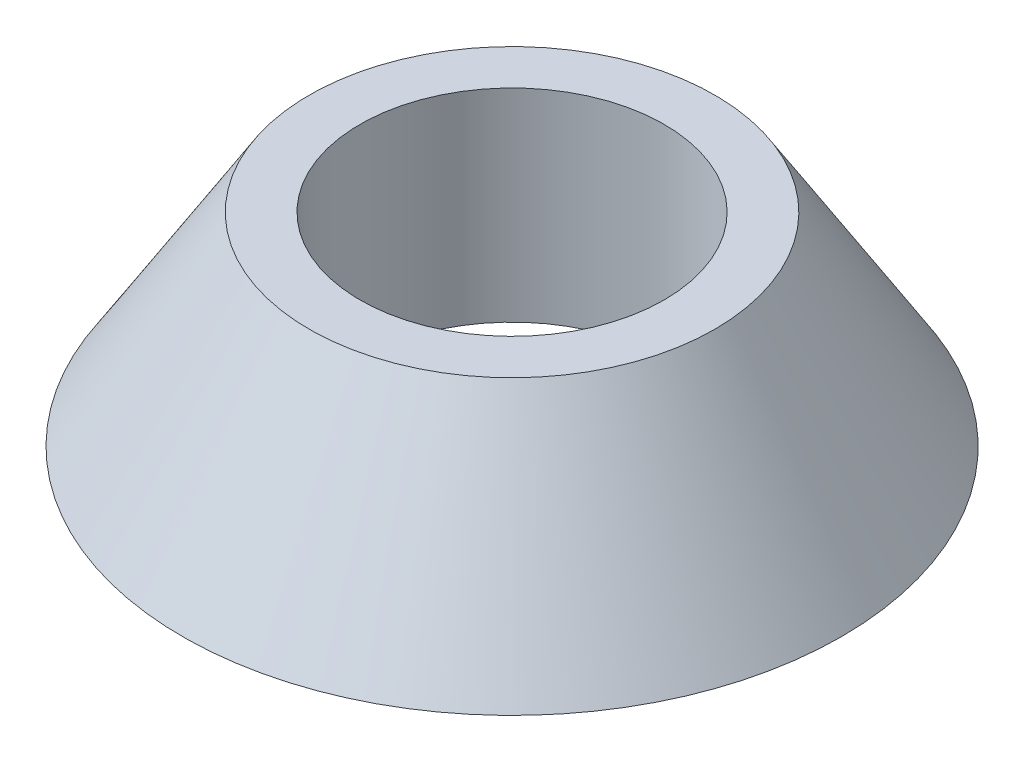
ISO-10303-21;
HEADER;
FILE_DESCRIPTION(('STEP AP214'),'2;1');
FILE_NAME('part.step','',(''),(''),'','','');
FILE_SCHEMA(('AUTOMOTIVE_DESIGN { 1 0 10303 214 1 1 1 1 }'));
ENDSEC;
DATA;
#1=APPLICATION_CONTEXT('core data for automotive mechanical design processes');
#2=APPLICATION_PROTOCOL_DEFINITION('international standard','automotive_design',2000,#1);
#3=PRODUCT_CONTEXT('',#1,'mechanical');
#4=PRODUCT('Part','Part','',(#3));
#5=PRODUCT_RELATED_PRODUCT_CATEGORY('part','',(#4));
#6=PRODUCT_DEFINITION_FORMATION('','',#4);
#7=PRODUCT_DEFINITION_CONTEXT('part definition',#1,'design');
#8=PRODUCT_DEFINITION('design','',#6,#7);
#9=PRODUCT_DEFINITION_SHAPE('','',#8);
#10=(LENGTH_UNIT() NAMED_UNIT(*) SI_UNIT(.MILLI.,.METRE.));
#11=(NAMED_UNIT(*) PLANE_ANGLE_UNIT() SI_UNIT($,.RADIAN.));
#12=(NAMED_UNIT(*) SI_UNIT($,.STERADIAN.) SOLID_ANGLE_UNIT());
#13=UNCERTAINTY_MEASURE_WITH_UNIT(LENGTH_MEASURE(1.E-05),#10,'distance_accuracy_value','');
#14=(GEOMETRIC_REPRESENTATION_CONTEXT(3) GLOBAL_UNCERTAINTY_ASSIGNED_CONTEXT((#13)) GLOBAL_UNIT_ASSIGNED_CONTEXT((#10,
#11,#12)) REPRESENTATION_CONTEXT('',''));
#15=CARTESIAN_POINT('',(0.,0.,0.));
#16=DIRECTION('',(0.,0.,1.));
#17=DIRECTION('',(1.,0.,0.));
#18=AXIS2_PLACEMENT_3D('',#15,#16,#17);
#19=CARTESIAN_POINT('',(6.5,0.,0.));
#20=DIRECTION('',(0.,-1.,0.));
#21=DIRECTION('',(1.,0.,0.));
#22=AXIS2_PLACEMENT_3D('',#19,#20,#21);
#23=PLANE('',#22);
#24=CARTESIAN_POINT('',(0.,0.,0.));
#25=DIRECTION('',(0.,-1.,0.));
#26=DIRECTION('',(1.,0.,0.));
#27=AXIS2_PLACEMENT_3D('',#24,#25,#26);
#28=CIRCLE('',#27,6.5);
#29=CARTESIAN_POINT('',(6.5,0.,0.));
#30=VERTEX_POINT('',#29);
#31=EDGE_CURVE('E46',#30,#30,#28,.T.);
#32=ORIENTED_EDGE('',*,*,#31,.T.);
#33=EDGE_LOOP('',(#32));
#34=FACE_BOUND('',#33,.T.);
#35=CARTESIAN_POINT('',(0.,0.,0.));
#36=DIRECTION('',(0.,-1.,0.));
#37=DIRECTION('',(1.,0.,0.));
#38=AXIS2_PLACEMENT_3D('',#35,#36,#37);
#39=CIRCLE('',#38,3.);
#40=CARTESIAN_POINT('',(3.,0.,0.));
#41=VERTEX_POINT('',#40);
#42=EDGE_CURVE('E10',#41,#41,#39,.T.);
#43=ORIENTED_EDGE('',*,*,#42,.F.);
#44=EDGE_LOOP('',(#43));
#45=FACE_BOUND('',#44,.T.);
#46=ADVANCED_FACE('F32',(#34,#45),#23,.T.);
#47=CARTESIAN_POINT('',(0.,0.,0.));
#48=DIRECTION('',(0.,-1.,0.));
#49=DIRECTION('',(1.,0.,0.));
#50=AXIS2_PLACEMENT_3D('',#47,#48,#49);
#51=CYLINDRICAL_SURFACE('',#50,3.00000000000001);
#52=ORIENTED_EDGE('',*,*,#42,.T.);
#53=EDGE_LOOP('',(#52));
#54=FACE_BOUND('',#53,.T.);
#55=CARTESIAN_POINT('',(0.,3.99999999999999,0.));
#56=DIRECTION('',(0.,-1.,0.));
#57=DIRECTION('',(1.,0.,0.));
#58=AXIS2_PLACEMENT_3D('',#55,#56,#57);
#59=CIRCLE('',#58,3.00000000000001);
#60=CARTESIAN_POINT('',(3.,4.,0.));
#61=VERTEX_POINT('',#60);
#62=EDGE_CURVE('E38',#61,#61,#59,.T.);
#63=ORIENTED_EDGE('',*,*,#62,.F.);
#64=EDGE_LOOP('',(#63));
#65=FACE_BOUND('',#64,.T.);
#66=ADVANCED_FACE('F62',(#54,#65),#51,.F.);
#67=CARTESIAN_POINT('',(3.,4.,0.));
#68=DIRECTION('',(0.,1.,0.));
#69=DIRECTION('',(-1.,0.,0.));
#70=AXIS2_PLACEMENT_3D('',#67,#68,#69);
#71=PLANE('',#70);
#72=ORIENTED_EDGE('',*,*,#62,.T.);
#73=EDGE_LOOP('',(#72));
#74=FACE_BOUND('',#73,.T.);
#75=CARTESIAN_POINT('',(0.,3.99999999999999,0.));
#76=DIRECTION('',(0.,-1.,0.));
#77=DIRECTION('',(1.,0.,0.));
#78=AXIS2_PLACEMENT_3D('',#75,#76,#77);
#79=CIRCLE('',#78,4.00000000000001);
#80=CARTESIAN_POINT('',(4.,4.,0.));
#81=VERTEX_POINT('',#80);
#82=EDGE_CURVE('E42',#81,#81,#79,.T.);
#83=ORIENTED_EDGE('',*,*,#82,.F.);
#84=EDGE_LOOP('',(#83));
#85=FACE_BOUND('',#84,.T.);
#86=ADVANCED_FACE('F56',(#74,#85),#71,.T.);
#87=CARTESIAN_POINT('',(0.,0.,0.));
#88=DIRECTION('',(0.,-1.,0.));
#89=DIRECTION('',(1.,0.,0.));
#90=AXIS2_PLACEMENT_3D('',#87,#88,#89);
#91=CONICAL_SURFACE('',#90,6.5,0.558599315343559);
#92=ORIENTED_EDGE('',*,*,#82,.T.);
#93=EDGE_LOOP('',(#92));
#94=FACE_BOUND('',#93,.T.);
#95=ORIENTED_EDGE('',*,*,#31,.F.);
#96=EDGE_LOOP('',(#95));
#97=FACE_BOUND('',#96,.T.);
#98=ADVANCED_FACE('F54',(#94,#97),#91,.T.);
#99=CLOSED_SHELL('',(#46,#66,#86,#98));
#100=MANIFOLD_SOLID_BREP('B2',#99);
#101=ADVANCED_BREP_SHAPE_REPRESENTATION('',(#18,#100),#14);
#102=SHAPE_DEFINITION_REPRESENTATION(#9,#101);
ENDSEC;
END-ISO-10303-21;
